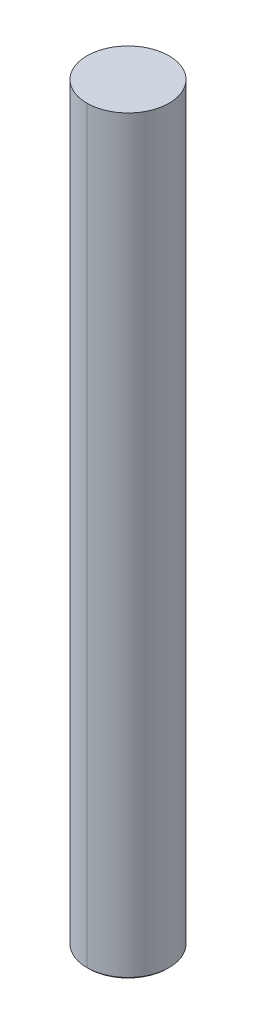
ISO-10303-21;
HEADER;
FILE_DESCRIPTION(('STEP AP214'),'2;1');
FILE_NAME('part.step','',(''),(''),'','','');
FILE_SCHEMA(('AUTOMOTIVE_DESIGN { 1 0 10303 214 1 1 1 1 }'));
ENDSEC;
DATA;
#1=APPLICATION_CONTEXT('core data for automotive mechanical design processes');
#2=APPLICATION_PROTOCOL_DEFINITION('international standard','automotive_design',2000,#1);
#3=PRODUCT_CONTEXT('',#1,'mechanical');
#4=PRODUCT('Part','Part','',(#3));
#5=PRODUCT_RELATED_PRODUCT_CATEGORY('part','',(#4));
#6=PRODUCT_DEFINITION_FORMATION('','',#4);
#7=PRODUCT_DEFINITION_CONTEXT('part definition',#1,'design');
#8=PRODUCT_DEFINITION('design','',#6,#7);
#9=PRODUCT_DEFINITION_SHAPE('','',#8);
#10=(LENGTH_UNIT() NAMED_UNIT(*) SI_UNIT(.MILLI.,.METRE.));
#11=(NAMED_UNIT(*) PLANE_ANGLE_UNIT() SI_UNIT($,.RADIAN.));
#12=(NAMED_UNIT(*) SI_UNIT($,.STERADIAN.) SOLID_ANGLE_UNIT());
#13=UNCERTAINTY_MEASURE_WITH_UNIT(LENGTH_MEASURE(1.E-05),#10,'distance_accuracy_value','');
#14=(GEOMETRIC_REPRESENTATION_CONTEXT(3) GLOBAL_UNCERTAINTY_ASSIGNED_CONTEXT((#13)) GLOBAL_UNIT_ASSIGNED_CONTEXT((#10,
#11,#12)) REPRESENTATION_CONTEXT('',''));
#15=CARTESIAN_POINT('',(0.,0.,0.));
#16=DIRECTION('',(0.,0.,1.));
#17=DIRECTION('',(1.,0.,0.));
#18=AXIS2_PLACEMENT_3D('',#15,#16,#17);
#19=CARTESIAN_POINT('',(0.,76.2,0.));
#20=DIRECTION('',(0.,-1.,0.));
#21=DIRECTION('',(0.,0.,-1.));
#22=AXIS2_PLACEMENT_3D('',#19,#20,#21);
#23=CYLINDRICAL_SURFACE('',#22,3.17119);
#24=DIRECTION('',(0.,-1.,0.));
#25=VECTOR('',#24,1.);
#26=CARTESIAN_POINT('',(0.,76.2,-3.17119));
#27=LINE('',#26,#25);
#28=CARTESIAN_POINT('',(0.,57.94,-3.17119));
#29=VERTEX_POINT('',#28);
#30=CARTESIAN_POINT('',(0.,0.127000000000058,-3.17119));
#31=VERTEX_POINT('',#30);
#32=EDGE_CURVE('E172',#29,#31,#27,.T.);
#33=ORIENTED_EDGE('',*,*,#32,.F.);
#34=CARTESIAN_POINT('',(0.,57.94,0.));
#35=DIRECTION('',(0.,1.,0.));
#36=DIRECTION('',(0.,0.,1.));
#37=AXIS2_PLACEMENT_3D('',#34,#35,#36);
#38=CIRCLE('',#37,3.17119);
#39=CARTESIAN_POINT('',(0.,57.94,3.17119));
#40=VERTEX_POINT('',#39);
#41=EDGE_CURVE('E60',#29,#40,#38,.F.);
#42=ORIENTED_EDGE('',*,*,#41,.T.);
#43=DIRECTION('',(0.,-1.,0.));
#44=VECTOR('',#43,1.);
#45=CARTESIAN_POINT('',(0.,76.2,3.17119));
#46=LINE('',#45,#44);
#47=CARTESIAN_POINT('',(0.,0.127000000000058,3.17119));
#48=VERTEX_POINT('',#47);
#49=EDGE_CURVE('E145',#40,#48,#46,.T.);
#50=ORIENTED_EDGE('',*,*,#49,.T.);
#51=CARTESIAN_POINT('',(0.,0.127000000000058,0.));
#52=DIRECTION('',(0.,1.,0.));
#53=DIRECTION('',(0.,0.,1.));
#54=AXIS2_PLACEMENT_3D('',#51,#52,#53);
#55=CIRCLE('',#54,3.17119);
#56=EDGE_CURVE('E149',#48,#31,#55,.T.);
#57=ORIENTED_EDGE('',*,*,#56,.T.);
#58=EDGE_LOOP('',(#33,#42,#50,#57));
#59=FACE_BOUND('',#58,.T.);
#60=ADVANCED_FACE('F45',(#59),#23,.T.);
#61=CARTESIAN_POINT('',(0.,76.2,0.));
#62=DIRECTION('',(0.,-1.,0.));
#63=DIRECTION('',(0.,0.,-1.));
#64=AXIS2_PLACEMENT_3D('',#61,#62,#63);
#65=CYLINDRICAL_SURFACE('',#64,3.17119);
#66=ORIENTED_EDGE('',*,*,#49,.F.);
#67=CARTESIAN_POINT('',(0.,57.94,0.));
#68=DIRECTION('',(0.,1.,0.));
#69=DIRECTION('',(0.,0.,1.));
#70=AXIS2_PLACEMENT_3D('',#67,#68,#69);
#71=CIRCLE('',#70,3.17119);
#72=EDGE_CURVE('E11',#40,#29,#71,.F.);
#73=ORIENTED_EDGE('',*,*,#72,.T.);
#74=ORIENTED_EDGE('',*,*,#32,.T.);
#75=CARTESIAN_POINT('',(0.,0.127000000000058,0.));
#76=DIRECTION('',(0.,1.,0.));
#77=DIRECTION('',(0.,0.,1.));
#78=AXIS2_PLACEMENT_3D('',#75,#76,#77);
#79=CIRCLE('',#78,3.17119);
#80=EDGE_CURVE('E163',#31,#48,#79,.T.);
#81=ORIENTED_EDGE('',*,*,#80,.T.);
#82=EDGE_LOOP('',(#66,#73,#74,#81));
#83=FACE_BOUND('',#82,.T.);
#84=ADVANCED_FACE('F176',(#83),#65,.T.);
#85=CARTESIAN_POINT('',(0.,0.,0.));
#86=DIRECTION('',(0.,-1.,0.));
#87=DIRECTION('',(0.,0.,-1.));
#88=AXIS2_PLACEMENT_3D('',#85,#86,#87);
#89=CYLINDRICAL_SURFACE('',#88,1.35255);
#90=CARTESIAN_POINT('',(0.,8.636,0.));
#91=DIRECTION('',(0.,-1.,0.));
#92=DIRECTION('',(0.,0.,-1.));
#93=AXIS2_PLACEMENT_3D('',#90,#91,#92);
#94=CIRCLE('',#93,1.35255);
#95=CARTESIAN_POINT('',(0.,8.636,1.35255));
#96=VERTEX_POINT('',#95);
#97=CARTESIAN_POINT('',(0.,8.636,-1.35255));
#98=VERTEX_POINT('',#97);
#99=EDGE_CURVE('E73',#96,#98,#94,.T.);
#100=ORIENTED_EDGE('',*,*,#99,.F.);
#101=DIRECTION('',(0.,-1.,0.));
#102=VECTOR('',#101,1.);
#103=CARTESIAN_POINT('',(0.,0.,1.35255));
#104=LINE('',#103,#102);
#105=CARTESIAN_POINT('',(0.,0.,1.35255));
#106=VERTEX_POINT('',#105);
#107=EDGE_CURVE('E54',#96,#106,#104,.T.);
#108=ORIENTED_EDGE('',*,*,#107,.T.);
#109=CARTESIAN_POINT('',(0.,0.,0.));
#110=DIRECTION('',(0.,-1.,0.));
#111=DIRECTION('',(0.,0.,-1.));
#112=AXIS2_PLACEMENT_3D('',#109,#110,#111);
#113=CIRCLE('',#112,1.35255);
#114=CARTESIAN_POINT('',(0.,0.,-1.35255));
#115=VERTEX_POINT('',#114);
#116=EDGE_CURVE('E122',#106,#115,#113,.T.);
#117=ORIENTED_EDGE('',*,*,#116,.T.);
#118=DIRECTION('',(0.,-1.,0.));
#119=VECTOR('',#118,1.);
#120=CARTESIAN_POINT('',(0.,0.,-1.35255));
#121=LINE('',#120,#119);
#122=EDGE_CURVE('E111',#98,#115,#121,.T.);
#123=ORIENTED_EDGE('',*,*,#122,.F.);
#124=EDGE_LOOP('',(#100,#108,#117,#123));
#125=FACE_BOUND('',#124,.T.);
#126=ADVANCED_FACE('F123',(#125),#89,.F.);
#127=CARTESIAN_POINT('',(0.,8.636,0.));
#128=DIRECTION('',(0.,-1.,0.));
#129=DIRECTION('',(0.,0.,-1.));
#130=AXIS2_PLACEMENT_3D('',#127,#128,#129);
#131=CONICAL_SURFACE('',#130,1.35255,1.02974425867665);
#132=DIRECTION('',(0.,-0.515038074910056,-0.857167300702111));
#133=VECTOR('',#132,1.);
#134=CARTESIAN_POINT('',(0.,8.636,-1.35255));
#135=LINE('',#134,#133);
#136=CARTESIAN_POINT('',(0.,9.44869403026573,0.));
#137=VERTEX_POINT('',#136);
#138=EDGE_CURVE('E142',#137,#98,#135,.T.);
#139=ORIENTED_EDGE('',*,*,#138,.F.);
#140=DIRECTION('',(0.,-0.515038074910056,0.857167300702111));
#141=VECTOR('',#140,1.);
#142=CARTESIAN_POINT('',(0.,8.636,1.35255));
#143=LINE('',#142,#141);
#144=EDGE_CURVE('E126',#137,#96,#143,.T.);
#145=ORIENTED_EDGE('',*,*,#144,.T.);
#146=ORIENTED_EDGE('',*,*,#99,.T.);
#147=EDGE_LOOP('',(#139,#145,#146));
#148=FACE_BOUND('',#147,.T.);
#149=ADVANCED_FACE('F191',(#148),#131,.F.);
#150=CARTESIAN_POINT('',(0.,0.127000000000058,0.));
#151=DIRECTION('',(0.,1.,0.));
#152=DIRECTION('',(0.,0.,1.));
#153=AXIS2_PLACEMENT_3D('',#150,#151,#152);
#154=CONICAL_SURFACE('',#153,3.17119,0.785398163397462);
#155=CARTESIAN_POINT('',(0.,0.,0.));
#156=DIRECTION('',(0.,-1.,0.));
#157=DIRECTION('',(0.,0.,1.));
#158=AXIS2_PLACEMENT_3D('',#155,#156,#157);
#159=CIRCLE('',#158,3.04418999999994);
#160=CARTESIAN_POINT('',(0.,0.,-3.04418999999994));
#161=VERTEX_POINT('',#160);
#162=CARTESIAN_POINT('',(0.,0.,3.04418999999994));
#163=VERTEX_POINT('',#162);
#164=EDGE_CURVE('E136',#161,#163,#159,.T.);
#165=ORIENTED_EDGE('',*,*,#164,.F.);
#166=DIRECTION('',(0.,0.707106781186538,-0.707106781186557));
#167=VECTOR('',#166,1.);
#168=CARTESIAN_POINT('',(0.,0.127000000000058,-3.17119));
#169=LINE('',#168,#167);
#170=EDGE_CURVE('E148',#161,#31,#169,.T.);
#171=ORIENTED_EDGE('',*,*,#170,.T.);
#172=ORIENTED_EDGE('',*,*,#56,.F.);
#173=DIRECTION('',(0.,0.707106781186538,0.707106781186557));
#174=VECTOR('',#173,1.);
#175=CARTESIAN_POINT('',(0.,0.127000000000058,3.17119));
#176=LINE('',#175,#174);
#177=EDGE_CURVE('E141',#163,#48,#176,.T.);
#178=ORIENTED_EDGE('',*,*,#177,.F.);
#179=EDGE_LOOP('',(#165,#171,#172,#178));
#180=FACE_BOUND('',#179,.T.);
#181=ADVANCED_FACE('F168',(#180),#154,.T.);
#182=CARTESIAN_POINT('',(0.,0.,0.));
#183=DIRECTION('',(0.,1.,0.));
#184=DIRECTION('',(1.,0.,0.));
#185=AXIS2_PLACEMENT_3D('',#182,#183,#184);
#186=PLANE('',#185);
#187=CARTESIAN_POINT('',(0.,0.,0.));
#188=DIRECTION('',(0.,-1.,0.));
#189=DIRECTION('',(0.,0.,1.));
#190=AXIS2_PLACEMENT_3D('',#187,#188,#189);
#191=CIRCLE('',#190,3.04418999999994);
#192=EDGE_CURVE('E140',#163,#161,#191,.T.);
#193=ORIENTED_EDGE('',*,*,#192,.T.);
#194=ORIENTED_EDGE('',*,*,#164,.T.);
#195=EDGE_LOOP('',(#193,#194));
#196=FACE_BOUND('',#195,.T.);
#197=CARTESIAN_POINT('',(0.,0.,0.));
#198=DIRECTION('',(0.,-1.,0.));
#199=DIRECTION('',(0.,0.,-1.));
#200=AXIS2_PLACEMENT_3D('',#197,#198,#199);
#201=CIRCLE('',#200,1.35255);
#202=EDGE_CURVE('E116',#115,#106,#201,.T.);
#203=ORIENTED_EDGE('',*,*,#202,.F.);
#204=ORIENTED_EDGE('',*,*,#116,.F.);
#205=EDGE_LOOP('',(#203,#204));
#206=FACE_BOUND('',#205,.T.);
#207=ADVANCED_FACE('F47',(#196,#206),#186,.F.);
#208=CARTESIAN_POINT('',(0.,0.127000000000058,0.));
#209=DIRECTION('',(0.,1.,0.));
#210=DIRECTION('',(0.,0.,1.));
#211=AXIS2_PLACEMENT_3D('',#208,#209,#210);
#212=CONICAL_SURFACE('',#211,3.17119,0.785398163397462);
#213=ORIENTED_EDGE('',*,*,#170,.F.);
#214=ORIENTED_EDGE('',*,*,#192,.F.);
#215=ORIENTED_EDGE('',*,*,#177,.T.);
#216=ORIENTED_EDGE('',*,*,#80,.F.);
#217=EDGE_LOOP('',(#213,#214,#215,#216));
#218=FACE_BOUND('',#217,.T.);
#219=ADVANCED_FACE('F161',(#218),#212,.T.);
#220=CARTESIAN_POINT('',(0.,8.636,0.));
#221=DIRECTION('',(0.,-1.,0.));
#222=DIRECTION('',(0.,0.,-1.));
#223=AXIS2_PLACEMENT_3D('',#220,#221,#222);
#224=CONICAL_SURFACE('',#223,1.35255,1.02974425867665);
#225=ORIENTED_EDGE('',*,*,#144,.F.);
#226=ORIENTED_EDGE('',*,*,#138,.T.);
#227=CARTESIAN_POINT('',(0.,8.636,0.));
#228=DIRECTION('',(0.,-1.,0.));
#229=DIRECTION('',(0.,0.,-1.));
#230=AXIS2_PLACEMENT_3D('',#227,#228,#229);
#231=CIRCLE('',#230,1.35255);
#232=EDGE_CURVE('E118',#98,#96,#231,.T.);
#233=ORIENTED_EDGE('',*,*,#232,.T.);
#234=EDGE_LOOP('',(#225,#226,#233));
#235=FACE_BOUND('',#234,.T.);
#236=ADVANCED_FACE('F194',(#235),#224,.F.);
#237=CARTESIAN_POINT('',(0.,0.,0.));
#238=DIRECTION('',(0.,-1.,0.));
#239=DIRECTION('',(0.,0.,-1.));
#240=AXIS2_PLACEMENT_3D('',#237,#238,#239);
#241=CYLINDRICAL_SURFACE('',#240,1.35255);
#242=ORIENTED_EDGE('',*,*,#107,.F.);
#243=ORIENTED_EDGE('',*,*,#232,.F.);
#244=ORIENTED_EDGE('',*,*,#122,.T.);
#245=ORIENTED_EDGE('',*,*,#202,.T.);
#246=EDGE_LOOP('',(#242,#243,#244,#245));
#247=FACE_BOUND('',#246,.T.);
#248=ADVANCED_FACE('F114',(#247),#241,.F.);
#249=CARTESIAN_POINT('',(0.,57.94,0.));
#250=DIRECTION('',(0.,1.,0.));
#251=DIRECTION('',(0.,0.,1.));
#252=AXIS2_PLACEMENT_3D('',#249,#250,#251);
#253=PLANE('',#252);
#254=ORIENTED_EDGE('',*,*,#72,.F.);
#255=ORIENTED_EDGE('',*,*,#41,.F.);
#256=EDGE_LOOP('',(#254,#255));
#257=FACE_BOUND('',#256,.T.);
#258=ADVANCED_FACE('F201',(#257),#253,.T.);
#259=CLOSED_SHELL('',(#60,#84,#126,#149,#181,#207,#219,#236,#248,#258));
#260=MANIFOLD_SOLID_BREP('B2',#259);
#261=ADVANCED_BREP_SHAPE_REPRESENTATION('',(#18,#260),#14);
#262=SHAPE_DEFINITION_REPRESENTATION(#9,#261);
ENDSEC;
END-ISO-10303-21;
